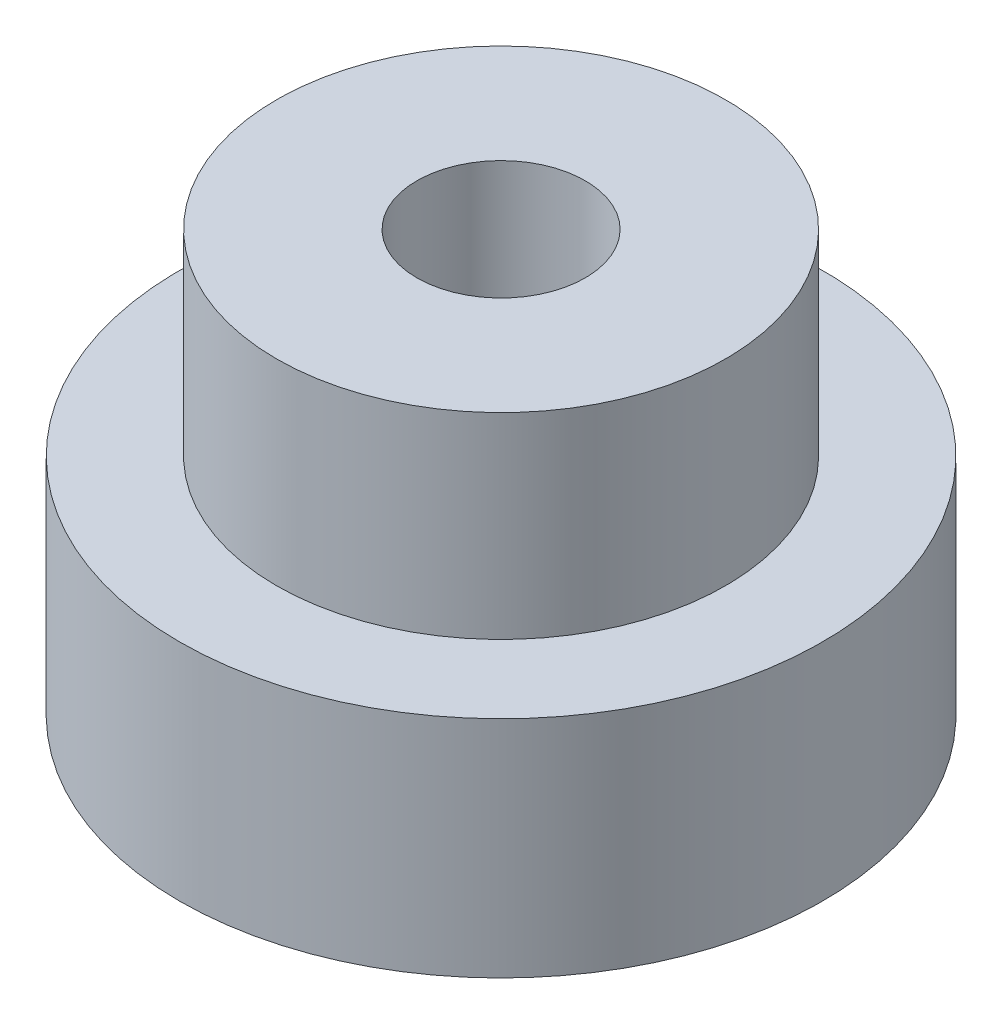
ISO-10303-21;
HEADER;
FILE_DESCRIPTION(('STEP AP214'),'2;1');
FILE_NAME('part.step','',(''),(''),'','','');
FILE_SCHEMA(('AUTOMOTIVE_DESIGN { 1 0 10303 214 1 1 1 1 }'));
ENDSEC;
DATA;
#1=APPLICATION_CONTEXT('core data for automotive mechanical design processes');
#2=APPLICATION_PROTOCOL_DEFINITION('international standard','automotive_design',2000,#1);
#3=PRODUCT_CONTEXT('',#1,'mechanical');
#4=PRODUCT('Part','Part','',(#3));
#5=PRODUCT_RELATED_PRODUCT_CATEGORY('part','',(#4));
#6=PRODUCT_DEFINITION_FORMATION('','',#4);
#7=PRODUCT_DEFINITION_CONTEXT('part definition',#1,'design');
#8=PRODUCT_DEFINITION('design','',#6,#7);
#9=PRODUCT_DEFINITION_SHAPE('','',#8);
#10=(LENGTH_UNIT() NAMED_UNIT(*) SI_UNIT(.MILLI.,.METRE.));
#11=(NAMED_UNIT(*) PLANE_ANGLE_UNIT() SI_UNIT($,.RADIAN.));
#12=(NAMED_UNIT(*) SI_UNIT($,.STERADIAN.) SOLID_ANGLE_UNIT());
#13=UNCERTAINTY_MEASURE_WITH_UNIT(LENGTH_MEASURE(1.E-05),#10,'distance_accuracy_value','');
#14=(GEOMETRIC_REPRESENTATION_CONTEXT(3) GLOBAL_UNCERTAINTY_ASSIGNED_CONTEXT((#13)) GLOBAL_UNIT_ASSIGNED_CONTEXT((#10,
#11,#12)) REPRESENTATION_CONTEXT('',''));
#15=CARTESIAN_POINT('',(0.,0.,0.));
#16=DIRECTION('',(0.,0.,1.));
#17=DIRECTION('',(1.,0.,0.));
#18=AXIS2_PLACEMENT_3D('',#15,#16,#17);
#19=CARTESIAN_POINT('',(0.,15.,0.));
#20=DIRECTION('',(0.,1.,0.));
#21=DIRECTION('',(0.,0.,1.));
#22=AXIS2_PLACEMENT_3D('',#19,#20,#21);
#23=PLANE('',#22);
#24=CARTESIAN_POINT('',(0.,15.,0.));
#25=DIRECTION('',(0.,1.,0.));
#26=DIRECTION('',(0.,0.,1.));
#27=AXIS2_PLACEMENT_3D('',#24,#25,#26);
#28=CIRCLE('',#27,8.);
#29=CARTESIAN_POINT('',(0.,15.,8.));
#30=VERTEX_POINT('',#29);
#31=EDGE_CURVE('E12',#30,#30,#28,.T.);
#32=ORIENTED_EDGE('',*,*,#31,.T.);
#33=EDGE_LOOP('',(#32));
#34=FACE_BOUND('',#33,.T.);
#35=CARTESIAN_POINT('',(0.,15.,0.));
#36=DIRECTION('',(0.,1.,0.));
#37=DIRECTION('',(0.,0.,1.));
#38=AXIS2_PLACEMENT_3D('',#35,#36,#37);
#39=CIRCLE('',#38,3.);
#40=CARTESIAN_POINT('',(0.,15.,3.));
#41=VERTEX_POINT('',#40);
#42=EDGE_CURVE('E59',#41,#41,#39,.T.);
#43=ORIENTED_EDGE('',*,*,#42,.F.);
#44=EDGE_LOOP('',(#43));
#45=FACE_BOUND('',#44,.T.);
#46=ADVANCED_FACE('F48',(#34,#45),#23,.T.);
#47=CARTESIAN_POINT('',(0.,8.,0.));
#48=DIRECTION('',(0.,1.,0.));
#49=DIRECTION('',(0.,0.,1.));
#50=AXIS2_PLACEMENT_3D('',#47,#48,#49);
#51=PLANE('',#50);
#52=CARTESIAN_POINT('',(0.,8.,0.));
#53=DIRECTION('',(0.,1.,0.));
#54=DIRECTION('',(0.,0.,1.));
#55=AXIS2_PLACEMENT_3D('',#52,#53,#54);
#56=CIRCLE('',#55,8.);
#57=CARTESIAN_POINT('',(0.,8.,8.));
#58=VERTEX_POINT('',#57);
#59=EDGE_CURVE('E52',#58,#58,#56,.T.);
#60=ORIENTED_EDGE('',*,*,#59,.F.);
#61=EDGE_LOOP('',(#60));
#62=FACE_BOUND('',#61,.T.);
#63=CARTESIAN_POINT('',(0.,8.,0.));
#64=DIRECTION('',(0.,1.,0.));
#65=DIRECTION('',(0.,0.,1.));
#66=AXIS2_PLACEMENT_3D('',#63,#64,#65);
#67=CIRCLE('',#66,3.);
#68=CARTESIAN_POINT('',(0.,8.,3.));
#69=VERTEX_POINT('',#68);
#70=EDGE_CURVE('E61',#69,#69,#67,.T.);
#71=ORIENTED_EDGE('',*,*,#70,.T.);
#72=EDGE_LOOP('',(#71));
#73=FACE_BOUND('',#72,.T.);
#74=ADVANCED_FACE('F71',(#62,#73),#51,.F.);
#75=CARTESIAN_POINT('',(0.,15.,0.));
#76=DIRECTION('',(0.,-1.,0.));
#77=DIRECTION('',(0.,0.,-1.));
#78=AXIS2_PLACEMENT_3D('',#75,#76,#77);
#79=CYLINDRICAL_SURFACE('',#78,8.);
#80=ORIENTED_EDGE('',*,*,#31,.F.);
#81=EDGE_LOOP('',(#80));
#82=FACE_BOUND('',#81,.T.);
#83=ORIENTED_EDGE('',*,*,#59,.T.);
#84=EDGE_LOOP('',(#83));
#85=FACE_BOUND('',#84,.T.);
#86=ADVANCED_FACE('F50',(#82,#85),#79,.T.);
#87=CARTESIAN_POINT('',(0.,15.,0.));
#88=DIRECTION('',(0.,-1.,0.));
#89=DIRECTION('',(0.,0.,-1.));
#90=AXIS2_PLACEMENT_3D('',#87,#88,#89);
#91=CYLINDRICAL_SURFACE('',#90,3.);
#92=ORIENTED_EDGE('',*,*,#42,.T.);
#93=EDGE_LOOP('',(#92));
#94=FACE_BOUND('',#93,.T.);
#95=ORIENTED_EDGE('',*,*,#70,.F.);
#96=EDGE_LOOP('',(#95));
#97=FACE_BOUND('',#96,.T.);
#98=ADVANCED_FACE('F67',(#94,#97),#91,.F.);
#99=CLOSED_SHELL('',(#46,#74,#86,#98));
#100=MANIFOLD_SOLID_BREP('B2',#99);
#101=CARTESIAN_POINT('',(0.,8.,0.));
#102=DIRECTION('',(0.,-1.,0.));
#103=DIRECTION('',(0.,0.,-1.));
#104=AXIS2_PLACEMENT_3D('',#101,#102,#103);
#105=CYLINDRICAL_SURFACE('',#104,8.);
#106=CARTESIAN_POINT('',(0.,8.,0.));
#107=DIRECTION('',(0.,1.,0.));
#108=DIRECTION('',(0.,0.,1.));
#109=AXIS2_PLACEMENT_3D('',#106,#107,#108);
#110=CIRCLE('',#109,8.);
#111=CARTESIAN_POINT('',(0.,8.,8.));
#112=VERTEX_POINT('',#111);
#113=EDGE_CURVE('E116',#112,#112,#110,.T.);
#114=ORIENTED_EDGE('',*,*,#113,.T.);
#115=EDGE_LOOP('',(#114));
#116=FACE_BOUND('',#115,.T.);
#117=CARTESIAN_POINT('',(0.,0.,0.));
#118=DIRECTION('',(0.,1.,0.));
#119=DIRECTION('',(0.,0.,1.));
#120=AXIS2_PLACEMENT_3D('',#117,#118,#119);
#121=CIRCLE('',#120,8.);
#122=CARTESIAN_POINT('',(0.,0.,8.));
#123=VERTEX_POINT('',#122);
#124=EDGE_CURVE('E122',#123,#123,#121,.T.);
#125=ORIENTED_EDGE('',*,*,#124,.F.);
#126=EDGE_LOOP('',(#125));
#127=FACE_BOUND('',#126,.T.);
#128=ADVANCED_FACE('F109',(#116,#127),#105,.F.);
#129=CARTESIAN_POINT('',(0.,8.,0.));
#130=DIRECTION('',(0.,-1.,0.));
#131=DIRECTION('',(0.,0.,-1.));
#132=AXIS2_PLACEMENT_3D('',#129,#130,#131);
#133=CYLINDRICAL_SURFACE('',#132,11.46);
#134=CARTESIAN_POINT('',(0.,8.,0.));
#135=DIRECTION('',(0.,1.,0.));
#136=DIRECTION('',(0.,0.,1.));
#137=AXIS2_PLACEMENT_3D('',#134,#135,#136);
#138=CIRCLE('',#137,11.46);
#139=CARTESIAN_POINT('',(0.,8.,11.46));
#140=VERTEX_POINT('',#139);
#141=EDGE_CURVE('E47',#140,#140,#138,.T.);
#142=ORIENTED_EDGE('',*,*,#141,.F.);
#143=EDGE_LOOP('',(#142));
#144=FACE_BOUND('',#143,.T.);
#145=CARTESIAN_POINT('',(0.,0.,0.));
#146=DIRECTION('',(0.,1.,0.));
#147=DIRECTION('',(0.,0.,1.));
#148=AXIS2_PLACEMENT_3D('',#145,#146,#147);
#149=CIRCLE('',#148,11.46);
#150=CARTESIAN_POINT('',(0.,0.,11.46));
#151=VERTEX_POINT('',#150);
#152=EDGE_CURVE('E112',#151,#151,#149,.T.);
#153=ORIENTED_EDGE('',*,*,#152,.T.);
#154=EDGE_LOOP('',(#153));
#155=FACE_BOUND('',#154,.T.);
#156=ADVANCED_FACE('F129',(#144,#155),#133,.T.);
#157=CARTESIAN_POINT('',(0.,8.,0.));
#158=DIRECTION('',(0.,1.,0.));
#159=DIRECTION('',(0.,0.,1.));
#160=AXIS2_PLACEMENT_3D('',#157,#158,#159);
#161=PLANE('',#160);
#162=ORIENTED_EDGE('',*,*,#113,.F.);
#163=EDGE_LOOP('',(#162));
#164=FACE_BOUND('',#163,.T.);
#165=ORIENTED_EDGE('',*,*,#141,.T.);
#166=EDGE_LOOP('',(#165));
#167=FACE_BOUND('',#166,.T.);
#168=ADVANCED_FACE('F133',(#164,#167),#161,.T.);
#169=CARTESIAN_POINT('',(0.,0.,0.));
#170=DIRECTION('',(0.,1.,0.));
#171=DIRECTION('',(0.,0.,1.));
#172=AXIS2_PLACEMENT_3D('',#169,#170,#171);
#173=PLANE('',#172);
#174=ORIENTED_EDGE('',*,*,#124,.T.);
#175=EDGE_LOOP('',(#174));
#176=FACE_BOUND('',#175,.T.);
#177=ORIENTED_EDGE('',*,*,#152,.F.);
#178=EDGE_LOOP('',(#177));
#179=FACE_BOUND('',#178,.T.);
#180=ADVANCED_FACE('F131',(#176,#179),#173,.F.);
#181=CLOSED_SHELL('',(#128,#156,#168,#180));
#182=MANIFOLD_SOLID_BREP('B7',#181);
#183=ADVANCED_BREP_SHAPE_REPRESENTATION('',(#18,#100,#182),#14);
#184=SHAPE_DEFINITION_REPRESENTATION(#9,#183);
ENDSEC;
END-ISO-10303-21;
